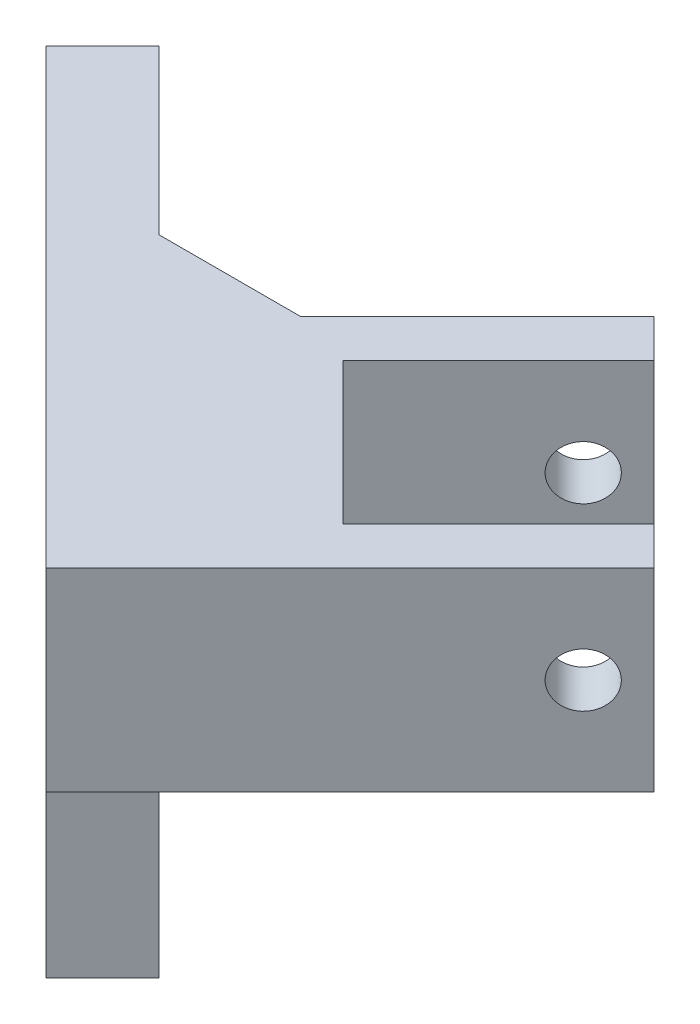
ISO-10303-21;
HEADER;
FILE_DESCRIPTION(('STEP AP214'),'2;1');
FILE_NAME('part.step','',(''),(''),'','','');
FILE_SCHEMA(('AUTOMOTIVE_DESIGN { 1 0 10303 214 1 1 1 1 }'));
ENDSEC;
DATA;
#1=APPLICATION_CONTEXT('core data for automotive mechanical design processes');
#2=APPLICATION_PROTOCOL_DEFINITION('international standard','automotive_design',2000,#1);
#3=PRODUCT_CONTEXT('',#1,'mechanical');
#4=PRODUCT('Part','Part','',(#3));
#5=PRODUCT_RELATED_PRODUCT_CATEGORY('part','',(#4));
#6=PRODUCT_DEFINITION_FORMATION('','',#4);
#7=PRODUCT_DEFINITION_CONTEXT('part definition',#1,'design');
#8=PRODUCT_DEFINITION('design','',#6,#7);
#9=PRODUCT_DEFINITION_SHAPE('','',#8);
#10=(LENGTH_UNIT() NAMED_UNIT(*) SI_UNIT(.MILLI.,.METRE.));
#11=(NAMED_UNIT(*) PLANE_ANGLE_UNIT() SI_UNIT($,.RADIAN.));
#12=(NAMED_UNIT(*) SI_UNIT($,.STERADIAN.) SOLID_ANGLE_UNIT());
#13=UNCERTAINTY_MEASURE_WITH_UNIT(LENGTH_MEASURE(1.E-05),#10,'distance_accuracy_value','');
#14=(GEOMETRIC_REPRESENTATION_CONTEXT(3) GLOBAL_UNCERTAINTY_ASSIGNED_CONTEXT((#13)) GLOBAL_UNIT_ASSIGNED_CONTEXT((#10,
#11,#12)) REPRESENTATION_CONTEXT('',''));
#15=CARTESIAN_POINT('',(0.,0.,0.));
#16=DIRECTION('',(0.,0.,1.));
#17=DIRECTION('',(1.,0.,0.));
#18=AXIS2_PLACEMENT_3D('',#15,#16,#17);
#19=CARTESIAN_POINT('',(31.0628181871188,32.8244024825225,-31.0628181871188));
#20=DIRECTION('',(0.,1.,0.));
#21=DIRECTION('',(0.,0.,1.));
#22=AXIS2_PLACEMENT_3D('',#19,#20,#21);
#23=PLANE('',#22);
#24=DIRECTION('',(0.707106781186547,0.,-0.707106781186548));
#25=VECTOR('',#24,1.);
#26=CARTESIAN_POINT('',(39.7549264490736,32.8244024825225,-22.370709925164));
#27=LINE('',#26,#25);
#28=CARTESIAN_POINT('',(54.6041688539911,32.8244024825225,-37.2199523300816));
#29=VERTEX_POINT('',#28);
#30=CARTESIAN_POINT('',(70.1605180400951,32.8244024825225,-52.7763015161856));
#31=VERTEX_POINT('',#30);
#32=EDGE_CURVE('E281',#29,#31,#27,.T.);
#33=ORIENTED_EDGE('',*,*,#32,.F.);
#34=DIRECTION('',(-0.707106781186546,0.,-0.707106781186549));
#35=VECTOR('',#34,1.);
#36=CARTESIAN_POINT('',(45.9120605920364,32.8244024825225,-45.9120605920363));
#37=LINE('',#36,#35);
#38=CARTESIAN_POINT('',(68.746304477722,32.8244024825225,-23.0778167063506));
#39=VERTEX_POINT('',#38);
#40=EDGE_CURVE('E283',#39,#29,#37,.T.);
#41=ORIENTED_EDGE('',*,*,#40,.F.);
#42=DIRECTION('',(-0.707106781186548,0.,0.707106781186547));
#43=VECTOR('',#42,1.);
#44=CARTESIAN_POINT('',(53.8970620728045,32.8244024825225,-8.22857430143308));
#45=LINE('',#44,#43);
#46=CARTESIAN_POINT('',(84.3026536638261,32.8244024825225,-38.6341658924546));
#47=VERTEX_POINT('',#46);
#48=EDGE_CURVE('E278',#47,#39,#45,.T.);
#49=ORIENTED_EDGE('',*,*,#48,.F.);
#50=DIRECTION('',(-0.707106781186547,0.,-0.707106781186547));
#51=VECTOR('',#50,1.);
#52=CARTESIAN_POINT('',(88.1320631514751,32.8244024825225,-34.8047564048057));
#53=LINE('',#52,#51);
#54=CARTESIAN_POINT('',(88.1320631514751,32.8244024825225,-34.8047564048057));
#55=VERTEX_POINT('',#54);
#56=EDGE_CURVE('E297',#55,#47,#53,.T.);
#57=ORIENTED_EDGE('',*,*,#56,.F.);
#58=DIRECTION('',(0.707106781186548,0.,-0.707106781186547));
#59=VECTOR('',#58,1.);
#60=CARTESIAN_POINT('',(57.7264715604535,32.8244024825225,-4.39916481378409));
#61=LINE('',#60,#59);
#62=CARTESIAN_POINT('',(57.7264715604535,32.8244024825225,-4.39916481378409));
#63=VERTEX_POINT('',#62);
#64=EDGE_CURVE('E354',#63,#55,#61,.T.);
#65=ORIENTED_EDGE('',*,*,#64,.F.);
#66=DIRECTION('',(0.707106781186547,0.,0.707106781186548));
#67=VECTOR('',#66,1.);
#68=CARTESIAN_POINT('',(31.0628181871188,32.8244024825225,-31.0628181871188));
#69=LINE('',#68,#67);
#70=CARTESIAN_POINT('',(31.0628181871188,32.8244024825225,-31.0628181871188));
#71=VERTEX_POINT('',#70);
#72=EDGE_CURVE('E315',#71,#63,#69,.T.);
#73=ORIENTED_EDGE('',*,*,#72,.F.);
#74=DIRECTION('',(0.707106781186548,0.,-0.707106781186547));
#75=VECTOR('',#74,1.);
#76=CARTESIAN_POINT('',(31.0628181871188,32.8244024825225,-31.0628181871188));
#77=LINE('',#76,#75);
#78=CARTESIAN_POINT('',(38.9280414741709,32.8244024825225,-38.9280414741709));
#79=VERTEX_POINT('',#78);
#80=EDGE_CURVE('E49',#71,#79,#77,.T.);
#81=ORIENTED_EDGE('',*,*,#80,.T.);
#82=DIRECTION('',(1.,0.,0.));
#83=VECTOR('',#82,1.);
#84=CARTESIAN_POINT('',(31.0628181871188,32.8244024825225,-38.9280414741709));
#85=LINE('',#84,#83);
#86=CARTESIAN_POINT('',(48.6534390227825,32.8244024825225,-38.9280414741709));
#87=VERTEX_POINT('',#86);
#88=EDGE_CURVE('E11',#79,#87,#85,.T.);
#89=ORIENTED_EDGE('',*,*,#88,.T.);
#90=DIRECTION('',(-0.707106781186548,0.,0.707106781186548));
#91=VECTOR('',#90,1.);
#92=CARTESIAN_POINT('',(66.3311085524461,32.8244024825225,-56.6057110038346));
#93=LINE('',#92,#91);
#94=CARTESIAN_POINT('',(66.3311085524461,32.8244024825225,-56.6057110038346));
#95=VERTEX_POINT('',#94);
#96=EDGE_CURVE('E305',#95,#87,#93,.T.);
#97=ORIENTED_EDGE('',*,*,#96,.F.);
#98=EDGE_CURVE('E296',#31,#95,#53,.T.);
#99=ORIENTED_EDGE('',*,*,#98,.F.);
#100=EDGE_LOOP('',(#33,#41,#49,#57,#65,#73,#81,#89,#97,#99));
#101=FACE_BOUND('',#100,.T.);
#102=ADVANCED_FACE('F34',(#101),#23,.F.);
#103=CARTESIAN_POINT('',(12.4905188287331,52.2462761201849,-49.6351175455045));
#104=DIRECTION('',(0.,-1.,0.));
#105=DIRECTION('',(0.,0.,-1.));
#106=AXIS2_PLACEMENT_3D('',#103,#104,#105);
#107=PLANE('',#106);
#108=DIRECTION('',(0.707106781186547,0.,-0.707106781186548));
#109=VECTOR('',#108,1.);
#110=CARTESIAN_POINT('',(54.6041688539911,52.2462761201849,-37.2199523300816));
#111=LINE('',#110,#109);
#112=CARTESIAN_POINT('',(54.6041688539911,52.2462761201849,-37.2199523300816));
#113=VERTEX_POINT('',#112);
#114=CARTESIAN_POINT('',(70.1605180400951,52.2462761201849,-52.7763015161856));
#115=VERTEX_POINT('',#114);
#116=EDGE_CURVE('E262',#113,#115,#111,.T.);
#117=ORIENTED_EDGE('',*,*,#116,.T.);
#118=DIRECTION('',(0.707106781186548,0.,0.707106781186547));
#119=VECTOR('',#118,1.);
#120=CARTESIAN_POINT('',(66.3311085524461,52.246276120185,-56.6057110038346));
#121=LINE('',#120,#119);
#122=CARTESIAN_POINT('',(66.3311085524461,52.246276120185,-56.6057110038346));
#123=VERTEX_POINT('',#122);
#124=EDGE_CURVE('E289',#123,#115,#121,.T.);
#125=ORIENTED_EDGE('',*,*,#124,.F.);
#126=DIRECTION('',(-0.707106781186548,0.,0.707106781186548));
#127=VECTOR('',#126,1.);
#128=CARTESIAN_POINT('',(66.3311085524461,52.246276120185,-56.6057110038346));
#129=LINE('',#128,#127);
#130=CARTESIAN_POINT('',(48.6534390227825,52.246276120185,-38.9280414741709));
#131=VERTEX_POINT('',#130);
#132=EDGE_CURVE('E302',#123,#131,#129,.T.);
#133=ORIENTED_EDGE('',*,*,#132,.T.);
#134=DIRECTION('',(-1.,0.,0.));
#135=VECTOR('',#134,1.);
#136=CARTESIAN_POINT('',(12.4905188287331,52.2462761201849,-38.9280414741708));
#137=LINE('',#136,#135);
#138=CARTESIAN_POINT('',(34.5113033990515,52.2462761201849,-38.9280414741709));
#139=VERTEX_POINT('',#138);
#140=EDGE_CURVE('E370',#131,#139,#137,.T.);
#141=ORIENTED_EDGE('',*,*,#140,.T.);
#142=DIRECTION('',(-0.707106781186547,0.,-0.707106781186548));
#143=VECTOR('',#142,1.);
#144=CARTESIAN_POINT('',(18.1473730782255,52.2462761201849,-55.2919717949969));
#145=LINE('',#144,#143);
#146=CARTESIAN_POINT('',(18.1473730782255,52.2462761201849,-55.2919717949969));
#147=VERTEX_POINT('',#146);
#148=EDGE_CURVE('E332',#139,#147,#145,.T.);
#149=ORIENTED_EDGE('',*,*,#148,.T.);
#150=DIRECTION('',(0.707106781186548,0.,-0.707106781186547));
#151=VECTOR('',#150,1.);
#152=CARTESIAN_POINT('',(12.4905188287331,52.2462761201849,-49.6351175455045));
#153=LINE('',#152,#151);
#154=CARTESIAN_POINT('',(12.4905188287331,52.2462761201849,-49.6351175455045));
#155=VERTEX_POINT('',#154);
#156=EDGE_CURVE('E348',#155,#147,#153,.T.);
#157=ORIENTED_EDGE('',*,*,#156,.F.);
#158=DIRECTION('',(-0.707106781186547,0.,-0.707106781186548));
#159=VECTOR('',#158,1.);
#160=CARTESIAN_POINT('',(12.4905188287331,52.2462761201849,-49.6351175455045));
#161=LINE('',#160,#159);
#162=CARTESIAN_POINT('',(57.7264715604535,52.2462761201849,-4.39916481378409));
#163=VERTEX_POINT('',#162);
#164=EDGE_CURVE('E319',#163,#155,#161,.T.);
#165=ORIENTED_EDGE('',*,*,#164,.F.);
#166=DIRECTION('',(0.707106781186548,0.,-0.707106781186547));
#167=VECTOR('',#166,1.);
#168=CARTESIAN_POINT('',(57.7264715604535,52.2462761201849,-4.39916481378409));
#169=LINE('',#168,#167);
#170=CARTESIAN_POINT('',(88.1320631514751,52.2462761201849,-34.8047564048057));
#171=VERTEX_POINT('',#170);
#172=EDGE_CURVE('E351',#163,#171,#169,.T.);
#173=ORIENTED_EDGE('',*,*,#172,.T.);
#174=CARTESIAN_POINT('',(84.3026536638261,52.2462761201849,-38.6341658924546));
#175=VERTEX_POINT('',#174);
#176=EDGE_CURVE('E293',#175,#171,#121,.T.);
#177=ORIENTED_EDGE('',*,*,#176,.F.);
#178=DIRECTION('',(-0.707106781186548,0.,0.707106781186547));
#179=VECTOR('',#178,1.);
#180=CARTESIAN_POINT('',(84.3026536638261,52.246276120185,-38.6341658924546));
#181=LINE('',#180,#179);
#182=CARTESIAN_POINT('',(68.746304477722,52.246276120185,-23.0778167063506));
#183=VERTEX_POINT('',#182);
#184=EDGE_CURVE('E265',#175,#183,#181,.T.);
#185=ORIENTED_EDGE('',*,*,#184,.T.);
#186=DIRECTION('',(-0.707106781186546,0.,-0.707106781186549));
#187=VECTOR('',#186,1.);
#188=CARTESIAN_POINT('',(68.746304477722,52.246276120185,-23.0778167063506));
#189=LINE('',#188,#187);
#190=EDGE_CURVE('E259',#183,#113,#189,.T.);
#191=ORIENTED_EDGE('',*,*,#190,.T.);
#192=EDGE_LOOP('',(#117,#125,#133,#141,#149,#157,#165,#173,#177,#185,#191));
#193=FACE_BOUND('',#192,.T.);
#194=ADVANCED_FACE('F434',(#193),#107,.F.);
#195=CARTESIAN_POINT('',(61.4684097781404,0.,-61.4684097781404));
#196=DIRECTION('',(0.707106781186547,0.,-0.707106781186548));
#197=DIRECTION('',(-0.707106781186548,0.,-0.707106781186547));
#198=AXIS2_PLACEMENT_3D('',#195,#196,#197);
#199=PLANE('',#198);
#200=ORIENTED_EDGE('',*,*,#124,.T.);
#201=DIRECTION('',(0.,1.,0.));
#202=VECTOR('',#201,1.);
#203=CARTESIAN_POINT('',(70.1605180400951,27.2462761201849,-52.7763015161856));
#204=LINE('',#203,#202);
#205=EDGE_CURVE('E273',#31,#115,#204,.T.);
#206=ORIENTED_EDGE('',*,*,#205,.F.);
#207=ORIENTED_EDGE('',*,*,#98,.T.);
#208=DIRECTION('',(0.,1.,0.));
#209=VECTOR('',#208,1.);
#210=CARTESIAN_POINT('',(66.3311085524461,32.8244024825225,-56.6057110038346));
#211=LINE('',#210,#209);
#212=EDGE_CURVE('E300',#95,#123,#211,.T.);
#213=ORIENTED_EDGE('',*,*,#212,.T.);
#214=EDGE_LOOP('',(#200,#206,#207,#213));
#215=FACE_BOUND('',#214,.T.);
#216=ADVANCED_FACE('F386',(#215),#199,.T.);
#217=ORIENTED_EDGE('',*,*,#56,.T.);
#218=DIRECTION('',(0.,1.,0.));
#219=VECTOR('',#218,1.);
#220=CARTESIAN_POINT('',(84.3026536638261,27.246276120185,-38.6341658924546));
#221=LINE('',#220,#219);
#222=EDGE_CURVE('E270',#47,#175,#221,.T.);
#223=ORIENTED_EDGE('',*,*,#222,.T.);
#224=ORIENTED_EDGE('',*,*,#176,.T.);
#225=DIRECTION('',(0.,-1.,0.));
#226=VECTOR('',#225,1.);
#227=CARTESIAN_POINT('',(88.1320631514751,52.2462761201849,-34.8047564048057));
#228=LINE('',#227,#226);
#229=EDGE_CURVE('E292',#171,#55,#228,.T.);
#230=ORIENTED_EDGE('',*,*,#229,.T.);
#231=EDGE_LOOP('',(#217,#223,#224,#230));
#232=FACE_BOUND('',#231,.T.);
#233=ADVANCED_FACE('F403',(#232),#199,.T.);
#234=CARTESIAN_POINT('',(52.7767240921477,42.5353393013537,-63.0890276522675));
#235=DIRECTION('',(0.707106781186547,0.,0.707106781186547));
#236=DIRECTION('',(0.707106781186548,0.,-0.707106781186548));
#237=AXIS2_PLACEMENT_3D('',#234,#235,#236);
#238=CYLINDRICAL_SURFACE('',#237,2.7);
#239=CARTESIAN_POINT('',(62.7955746465134,42.5353393013537,-53.0701770979018));
#240=DIRECTION('',(0.707106781186548,0.,0.707106781186548));
#241=DIRECTION('',(0.707106781186548,0.,-0.707106781186548));
#242=AXIS2_PLACEMENT_3D('',#239,#240,#241);
#243=CIRCLE('',#242,2.7);
#244=CARTESIAN_POINT('',(64.704762955717,42.5353393013537,-54.9793654071055));
#245=VERTEX_POINT('',#244);
#246=EDGE_CURVE('E288',#245,#245,#243,.T.);
#247=ORIENTED_EDGE('',*,*,#246,.F.);
#248=EDGE_LOOP('',(#247));
#249=FACE_BOUND('',#248,.T.);
#250=CARTESIAN_POINT('',(66.6249841341624,42.5353393013537,-49.2407676102528));
#251=DIRECTION('',(0.707106781186548,0.,0.707106781186547));
#252=DIRECTION('',(0.707106781186547,0.,-0.707106781186548));
#253=AXIS2_PLACEMENT_3D('',#250,#251,#252);
#254=CIRCLE('',#253,2.7);
#255=CARTESIAN_POINT('',(68.5341724433661,42.5353393013537,-51.1499559194565));
#256=VERTEX_POINT('',#255);
#257=EDGE_CURVE('E280',#256,#256,#254,.F.);
#258=ORIENTED_EDGE('',*,*,#257,.F.);
#259=EDGE_LOOP('',(#258));
#260=FACE_BOUND('',#259,.T.);
#261=ADVANCED_FACE('F460',(#249,#260),#238,.F.);
#262=CARTESIAN_POINT('',(84.5965292455423,42.5353393013537,-31.2692224988729));
#263=DIRECTION('',(0.707106781186548,0.,0.707106781186548));
#264=DIRECTION('',(0.707106781186548,0.,-0.707106781186548));
#265=AXIS2_PLACEMENT_3D('',#262,#263,#264);
#266=CIRCLE('',#265,2.7);
#267=CARTESIAN_POINT('',(86.505717554746,42.5353393013537,-33.1784108080766));
#268=VERTEX_POINT('',#267);
#269=EDGE_CURVE('E285',#268,#268,#266,.T.);
#270=ORIENTED_EDGE('',*,*,#269,.T.);
#271=EDGE_LOOP('',(#270));
#272=FACE_BOUND('',#271,.T.);
#273=CARTESIAN_POINT('',(80.7671197578933,42.5353393013537,-35.0986319865219));
#274=DIRECTION('',(-0.707106781186547,0.,-0.707106781186548));
#275=DIRECTION('',(-0.707106781186548,0.,0.707106781186547));
#276=AXIS2_PLACEMENT_3D('',#273,#274,#275);
#277=CIRCLE('',#276,2.7);
#278=CARTESIAN_POINT('',(78.8579314486897,42.5353393013537,-33.1894436773182));
#279=VERTEX_POINT('',#278);
#280=EDGE_CURVE('E277',#279,#279,#277,.F.);
#281=ORIENTED_EDGE('',*,*,#280,.F.);
#282=EDGE_LOOP('',(#281));
#283=FACE_BOUND('',#282,.T.);
#284=ADVANCED_FACE('F454',(#272,#283),#238,.F.);
#285=CARTESIAN_POINT('',(36.7196724366112,0.,-36.7196724366112));
#286=DIRECTION('',(0.707106781186548,0.,-0.707106781186547));
#287=DIRECTION('',(-0.707106781186547,0.,-0.707106781186548));
#288=AXIS2_PLACEMENT_3D('',#285,#286,#287);
#289=PLANE('',#288);
#290=CARTESIAN_POINT('',(23.9186035962073,-11.8888107983741,-49.5207412770151));
#291=DIRECTION('',(0.707106781186548,0.,-0.707106781186547));
#292=DIRECTION('',(-0.707106781186547,0.,-0.707106781186548));
#293=AXIS2_PLACEMENT_3D('',#290,#291,#292);
#294=CIRCLE('',#293,1.85);
#295=CARTESIAN_POINT('',(25.2267511414024,-11.8888107983741,-48.21259373182));
#296=VERTEX_POINT('',#295);
#297=CARTESIAN_POINT('',(22.6104560510122,-11.8888107983741,-50.8288888222102));
#298=VERTEX_POINT('',#297);
#299=EDGE_CURVE('E198',#296,#298,#294,.T.);
#300=ORIENTED_EDGE('',*,*,#299,.F.);
#301=DIRECTION('',(0.,-1.,0.));
#302=VECTOR('',#301,1.);
#303=CARTESIAN_POINT('',(25.2267511414024,0.,-48.21259373182));
#304=LINE('',#303,#302);
#305=CARTESIAN_POINT('',(25.2267511414024,19.9311892016259,-48.21259373182));
#306=VERTEX_POINT('',#305);
#307=EDGE_CURVE('E251',#306,#296,#304,.T.);
#308=ORIENTED_EDGE('',*,*,#307,.F.);
#309=CARTESIAN_POINT('',(23.9186035962073,19.9311892016259,-49.5207412770151));
#310=DIRECTION('',(0.707106781186548,0.,-0.707106781186547));
#311=DIRECTION('',(-0.707106781186547,0.,-0.707106781186548));
#312=AXIS2_PLACEMENT_3D('',#309,#310,#311);
#313=CIRCLE('',#312,1.85);
#314=CARTESIAN_POINT('',(22.6104560510122,19.9311892016259,-50.8288888222102));
#315=VERTEX_POINT('',#314);
#316=EDGE_CURVE('E253',#315,#306,#313,.T.);
#317=ORIENTED_EDGE('',*,*,#316,.F.);
#318=DIRECTION('',(0.,-1.,0.));
#319=VECTOR('',#318,1.);
#320=CARTESIAN_POINT('',(22.6104560510122,0.,-50.8288888222102));
#321=LINE('',#320,#319);
#322=EDGE_CURVE('E256',#315,#298,#321,.T.);
#323=ORIENTED_EDGE('',*,*,#322,.T.);
#324=EDGE_LOOP('',(#300,#308,#317,#323));
#325=FACE_BOUND('',#324,.T.);
#326=DIRECTION('',(0.,-1.,0.));
#327=VECTOR('',#326,1.);
#328=CARTESIAN_POINT('',(15.5393882391467,0.,-57.8999566340757));
#329=LINE('',#328,#327);
#330=CARTESIAN_POINT('',(15.5393882391467,19.9311892016259,-57.8999566340757));
#331=VERTEX_POINT('',#330);
#332=CARTESIAN_POINT('',(15.5393882391467,-11.8888107983741,-57.8999566340757));
#333=VERTEX_POINT('',#332);
#334=EDGE_CURVE('E249',#331,#333,#329,.T.);
#335=ORIENTED_EDGE('',*,*,#334,.F.);
#336=CARTESIAN_POINT('',(14.2312406939516,19.9311892016259,-59.2081041792708));
#337=DIRECTION('',(0.707106781186548,0.,-0.707106781186547));
#338=DIRECTION('',(-0.707106781186547,0.,-0.707106781186548));
#339=AXIS2_PLACEMENT_3D('',#336,#337,#338);
#340=CIRCLE('',#339,1.85);
#341=CARTESIAN_POINT('',(12.9230931487565,19.9311892016259,-60.5162517244659));
#342=VERTEX_POINT('',#341);
#343=EDGE_CURVE('E236',#342,#331,#340,.T.);
#344=ORIENTED_EDGE('',*,*,#343,.F.);
#345=DIRECTION('',(0.,-1.,0.));
#346=VECTOR('',#345,1.);
#347=CARTESIAN_POINT('',(12.9230931487565,0.,-60.5162517244659));
#348=LINE('',#347,#346);
#349=CARTESIAN_POINT('',(12.9230931487565,-11.8888107983741,-60.5162517244659));
#350=VERTEX_POINT('',#349);
#351=EDGE_CURVE('E244',#342,#350,#348,.T.);
#352=ORIENTED_EDGE('',*,*,#351,.T.);
#353=CARTESIAN_POINT('',(14.2312406939516,-11.8888107983741,-59.2081041792708));
#354=DIRECTION('',(0.707106781186548,0.,-0.707106781186547));
#355=DIRECTION('',(-0.707106781186547,0.,-0.707106781186548));
#356=AXIS2_PLACEMENT_3D('',#353,#354,#355);
#357=CIRCLE('',#356,1.85);
#358=EDGE_CURVE('E247',#333,#350,#357,.T.);
#359=ORIENTED_EDGE('',*,*,#358,.F.);
#360=EDGE_LOOP('',(#335,#344,#352,#359));
#361=FACE_BOUND('',#360,.T.);
#362=ORIENTED_EDGE('',*,*,#148,.F.);
#363=DIRECTION('',(0.,-1.,0.));
#364=VECTOR('',#363,1.);
#365=CARTESIAN_POINT('',(34.5113033990515,0.,-38.9280414741709));
#366=LINE('',#365,#364);
#367=CARTESIAN_POINT('',(34.5113033990515,29.7012970388808,-38.9280414741709));
#368=VERTEX_POINT('',#367);
#369=EDGE_CURVE('E57',#139,#368,#366,.T.);
#370=ORIENTED_EDGE('',*,*,#369,.T.);
#371=DIRECTION('',(0.500000000000001,0.707106781186546,0.500000000000001));
#372=VECTOR('',#371,1.);
#373=CARTESIAN_POINT('',(30.1332776936908,23.5098337099417,-43.3060671795316));
#374=LINE('',#373,#372);
#375=CARTESIAN_POINT('',(30.1332776936908,23.5098337099417,-43.3060671795316));
#376=VERTEX_POINT('',#375);
#377=EDGE_CURVE('E330',#376,#368,#374,.T.);
#378=ORIENTED_EDGE('',*,*,#377,.F.);
#379=DIRECTION('',(0.,1.,0.));
#380=VECTOR('',#379,1.);
#381=CARTESIAN_POINT('',(30.1332776936908,-16.523019044903,-43.3060671795316));
#382=LINE('',#381,#380);
#383=CARTESIAN_POINT('',(30.1332776936908,-16.523019044903,-43.3060671795316));
#384=VERTEX_POINT('',#383);
#385=EDGE_CURVE('E308',#384,#376,#382,.T.);
#386=ORIENTED_EDGE('',*,*,#385,.F.);
#387=DIRECTION('',(0.707106781186548,0.,0.707106781186548));
#388=VECTOR('',#387,1.);
#389=CARTESIAN_POINT('',(8.01656659646805,-16.523019044903,-65.4227782767543));
#390=LINE('',#389,#388);
#391=CARTESIAN_POINT('',(8.01656659646805,-16.523019044903,-65.4227782767543));
#392=VERTEX_POINT('',#391);
#393=EDGE_CURVE('E313',#392,#384,#390,.T.);
#394=ORIENTED_EDGE('',*,*,#393,.F.);
#395=DIRECTION('',(0.,-1.,0.));
#396=VECTOR('',#395,1.);
#397=CARTESIAN_POINT('',(8.01656659646804,32.8244024825225,-65.4227782767543));
#398=LINE('',#397,#396);
#399=CARTESIAN_POINT('',(8.01656659646804,37.9191521959063,-65.4227782767543));
#400=VERTEX_POINT('',#399);
#401=EDGE_CURVE('E337',#400,#392,#398,.T.);
#402=ORIENTED_EDGE('',*,*,#401,.F.);
#403=DIRECTION('',(-0.500000000000001,-0.707106781186546,-0.500000000000001));
#404=VECTOR('',#403,1.);
#405=CARTESIAN_POINT('',(8.01656659646804,37.9191521959063,-65.4227782767543));
#406=LINE('',#405,#404);
#407=EDGE_CURVE('E334',#147,#400,#406,.T.);
#408=ORIENTED_EDGE('',*,*,#407,.F.);
#409=EDGE_LOOP('',(#362,#370,#378,#386,#394,#402,#408));
#410=FACE_BOUND('',#409,.T.);
#411=ADVANCED_FACE('F419',(#325,#361,#410),#289,.T.);
#412=CARTESIAN_POINT('',(24.4764234441984,-16.523019044903,-37.6492129300392));
#413=DIRECTION('',(-0.707106781186547,0.,-0.707106781186548));
#414=DIRECTION('',(-0.707106781186548,0.,0.707106781186547));
#415=AXIS2_PLACEMENT_3D('',#412,#413,#414);
#416=PLANE('',#415);
#417=ORIENTED_EDGE('',*,*,#385,.T.);
#418=DIRECTION('',(0.707106781186548,0.,-0.707106781186547));
#419=VECTOR('',#418,1.);
#420=CARTESIAN_POINT('',(24.4764234441984,23.5098337099417,-37.6492129300392));
#421=LINE('',#420,#419);
#422=CARTESIAN_POINT('',(24.4764234441984,23.5098337099417,-37.6492129300392));
#423=VERTEX_POINT('',#422);
#424=EDGE_CURVE('E357',#423,#376,#421,.T.);
#425=ORIENTED_EDGE('',*,*,#424,.F.);
#426=DIRECTION('',(0.,1.,0.));
#427=VECTOR('',#426,1.);
#428=CARTESIAN_POINT('',(24.4764234441984,-16.523019044903,-37.6492129300392));
#429=LINE('',#428,#427);
#430=CARTESIAN_POINT('',(24.4764234441984,-16.523019044903,-37.6492129300392));
#431=VERTEX_POINT('',#430);
#432=EDGE_CURVE('E309',#431,#423,#429,.T.);
#433=ORIENTED_EDGE('',*,*,#432,.F.);
#434=DIRECTION('',(0.707106781186548,0.,-0.707106781186547));
#435=VECTOR('',#434,1.);
#436=CARTESIAN_POINT('',(24.4764234441984,-16.523019044903,-37.6492129300392));
#437=LINE('',#436,#435);
#438=EDGE_CURVE('E327',#431,#384,#437,.T.);
#439=ORIENTED_EDGE('',*,*,#438,.T.);
#440=EDGE_LOOP('',(#417,#425,#433,#439));
#441=FACE_BOUND('',#440,.T.);
#442=ADVANCED_FACE('F416',(#441),#416,.F.);
#443=CARTESIAN_POINT('',(24.4764234441984,23.5098337099417,-37.6492129300392));
#444=DIRECTION('',(-0.499999999999999,0.707106781186549,-0.499999999999999));
#445=DIRECTION('',(0.,0.577350269189624,0.816496580927727));
#446=AXIS2_PLACEMENT_3D('',#443,#444,#445);
#447=PLANE('',#446);
#448=ORIENTED_EDGE('',*,*,#377,.T.);
#449=DIRECTION('',(0.816496580927729,0.577350269189622,0.));
#450=VECTOR('',#449,1.);
#451=CARTESIAN_POINT('',(24.9026996255756,22.9069881529214,-38.9280414741708));
#452=LINE('',#451,#450);
#453=EDGE_CURVE('E43',#368,#79,#452,.T.);
#454=ORIENTED_EDGE('',*,*,#453,.T.);
#455=ORIENTED_EDGE('',*,*,#80,.F.);
#456=DIRECTION('',(0.500000000000001,0.707106781186546,0.500000000000001));
#457=VECTOR('',#456,1.);
#458=CARTESIAN_POINT('',(24.4764234441984,23.5098337099417,-37.6492129300392));
#459=LINE('',#458,#457);
#460=EDGE_CURVE('E312',#423,#71,#459,.T.);
#461=ORIENTED_EDGE('',*,*,#460,.F.);
#462=ORIENTED_EDGE('',*,*,#424,.T.);
#463=EDGE_LOOP('',(#448,#454,#455,#461,#462));
#464=FACE_BOUND('',#463,.T.);
#465=ADVANCED_FACE('F374',(#464),#447,.F.);
#466=CARTESIAN_POINT('',(57.7264715604535,52.2462761201849,-4.39916481378409));
#467=DIRECTION('',(-0.707106781186547,0.,-0.707106781186548));
#468=DIRECTION('',(-0.707106781186548,0.,0.707106781186547));
#469=AXIS2_PLACEMENT_3D('',#466,#467,#468);
#470=PLANE('',#469);
#471=ORIENTED_EDGE('',*,*,#269,.F.);
#472=EDGE_LOOP('',(#471));
#473=FACE_BOUND('',#472,.T.);
#474=ORIENTED_EDGE('',*,*,#64,.T.);
#475=ORIENTED_EDGE('',*,*,#229,.F.);
#476=ORIENTED_EDGE('',*,*,#172,.F.);
#477=DIRECTION('',(0.,1.,0.));
#478=VECTOR('',#477,1.);
#479=CARTESIAN_POINT('',(57.7264715604535,52.2462761201849,-4.39916481378409));
#480=LINE('',#479,#478);
#481=EDGE_CURVE('E317',#63,#163,#480,.T.);
#482=ORIENTED_EDGE('',*,*,#481,.F.);
#483=EDGE_LOOP('',(#474,#475,#476,#482));
#484=FACE_BOUND('',#483,.T.);
#485=ADVANCED_FACE('F408',(#473,#484),#470,.F.);
#486=CARTESIAN_POINT('',(2.35971234697566,37.9191521959063,-59.765924027262));
#487=DIRECTION('',(0.499999999999999,-0.707106781186549,0.499999999999999));
#488=DIRECTION('',(0.,-0.577350269189625,-0.816496580927727));
#489=AXIS2_PLACEMENT_3D('',#486,#487,#488);
#490=PLANE('',#489);
#491=ORIENTED_EDGE('',*,*,#407,.T.);
#492=DIRECTION('',(0.707106781186548,0.,-0.707106781186547));
#493=VECTOR('',#492,1.);
#494=CARTESIAN_POINT('',(2.35971234697566,37.9191521959063,-59.765924027262));
#495=LINE('',#494,#493);
#496=CARTESIAN_POINT('',(2.35971234697566,37.9191521959063,-59.765924027262));
#497=VERTEX_POINT('',#496);
#498=EDGE_CURVE('E345',#497,#400,#495,.T.);
#499=ORIENTED_EDGE('',*,*,#498,.F.);
#500=DIRECTION('',(-0.500000000000001,-0.707106781186546,-0.500000000000001));
#501=VECTOR('',#500,1.);
#502=CARTESIAN_POINT('',(2.35971234697566,37.9191521959063,-59.765924027262));
#503=LINE('',#502,#501);
#504=EDGE_CURVE('E321',#155,#497,#503,.T.);
#505=ORIENTED_EDGE('',*,*,#504,.F.);
#506=ORIENTED_EDGE('',*,*,#156,.T.);
#507=EDGE_LOOP('',(#491,#499,#505,#506));
#508=FACE_BOUND('',#507,.T.);
#509=ADVANCED_FACE('F431',(#508),#490,.F.);
#510=CARTESIAN_POINT('',(2.35971234697566,32.8244024825225,-59.765924027262));
#511=DIRECTION('',(0.707106781186547,0.,0.707106781186548));
#512=DIRECTION('',(0.707106781186548,0.,-0.707106781186547));
#513=AXIS2_PLACEMENT_3D('',#510,#511,#512);
#514=PLANE('',#513);
#515=ORIENTED_EDGE('',*,*,#401,.T.);
#516=DIRECTION('',(0.707106781186548,0.,-0.707106781186547));
#517=VECTOR('',#516,1.);
#518=CARTESIAN_POINT('',(2.35971234697567,-16.523019044903,-59.7659240272619));
#519=LINE('',#518,#517);
#520=CARTESIAN_POINT('',(2.35971234697567,-16.523019044903,-59.7659240272619));
#521=VERTEX_POINT('',#520);
#522=EDGE_CURVE('E342',#521,#392,#519,.T.);
#523=ORIENTED_EDGE('',*,*,#522,.F.);
#524=DIRECTION('',(0.,-1.,0.));
#525=VECTOR('',#524,1.);
#526=CARTESIAN_POINT('',(2.35971234697566,32.8244024825225,-59.765924027262));
#527=LINE('',#526,#525);
#528=EDGE_CURVE('E323',#497,#521,#527,.T.);
#529=ORIENTED_EDGE('',*,*,#528,.F.);
#530=ORIENTED_EDGE('',*,*,#498,.T.);
#531=EDGE_LOOP('',(#515,#523,#529,#530));
#532=FACE_BOUND('',#531,.T.);
#533=ADVANCED_FACE('F427',(#532),#514,.F.);
#534=CARTESIAN_POINT('',(2.35971234697567,-16.523019044903,-59.7659240272619));
#535=DIRECTION('',(0.,1.,0.));
#536=DIRECTION('',(0.,0.,1.));
#537=AXIS2_PLACEMENT_3D('',#534,#535,#536);
#538=PLANE('',#537);
#539=ORIENTED_EDGE('',*,*,#393,.T.);
#540=ORIENTED_EDGE('',*,*,#438,.F.);
#541=DIRECTION('',(0.707106781186548,0.,0.707106781186548));
#542=VECTOR('',#541,1.);
#543=CARTESIAN_POINT('',(2.35971234697567,-16.523019044903,-59.7659240272619));
#544=LINE('',#543,#542);
#545=EDGE_CURVE('E325',#521,#431,#544,.T.);
#546=ORIENTED_EDGE('',*,*,#545,.F.);
#547=ORIENTED_EDGE('',*,*,#522,.T.);
#548=EDGE_LOOP('',(#539,#540,#546,#547));
#549=FACE_BOUND('',#548,.T.);
#550=ADVANCED_FACE('F422',(#549),#538,.F.);
#551=CARTESIAN_POINT('',(31.0628181871188,0.,-31.0628181871188));
#552=DIRECTION('',(0.707106781186548,0.,-0.707106781186547));
#553=DIRECTION('',(-0.707106781186547,0.,-0.707106781186548));
#554=AXIS2_PLACEMENT_3D('',#551,#552,#553);
#555=PLANE('',#554);
#556=DIRECTION('',(0.,1.,0.));
#557=VECTOR('',#556,1.);
#558=CARTESIAN_POINT('',(19.56989689191,-11.8888107983741,-42.5557394823276));
#559=LINE('',#558,#557);
#560=CARTESIAN_POINT('',(19.56989689191,-11.8888107983741,-42.5557394823276));
#561=VERTEX_POINT('',#560);
#562=CARTESIAN_POINT('',(19.56989689191,19.9311892016259,-42.5557394823276));
#563=VERTEX_POINT('',#562);
#564=EDGE_CURVE('E217',#561,#563,#559,.T.);
#565=ORIENTED_EDGE('',*,*,#564,.F.);
#566=CARTESIAN_POINT('',(18.2617493467149,-11.8888107983741,-43.8638870275227));
#567=DIRECTION('',(-0.707106781186548,0.,0.707106781186547));
#568=DIRECTION('',(0.707106781186547,0.,0.707106781186548));
#569=AXIS2_PLACEMENT_3D('',#566,#567,#568);
#570=CIRCLE('',#569,1.85);
#571=CARTESIAN_POINT('',(16.9536018015198,-11.8888107983741,-45.1720345727178));
#572=VERTEX_POINT('',#571);
#573=EDGE_CURVE('E195',#572,#561,#570,.T.);
#574=ORIENTED_EDGE('',*,*,#573,.F.);
#575=DIRECTION('',(0.,1.,0.));
#576=VECTOR('',#575,1.);
#577=CARTESIAN_POINT('',(16.9536018015198,-11.8888107983741,-45.1720345727178));
#578=LINE('',#577,#576);
#579=CARTESIAN_POINT('',(16.9536018015198,19.9311892016259,-45.1720345727178));
#580=VERTEX_POINT('',#579);
#581=EDGE_CURVE('E204',#572,#580,#578,.T.);
#582=ORIENTED_EDGE('',*,*,#581,.T.);
#583=CARTESIAN_POINT('',(18.2617493467149,19.9311892016259,-43.8638870275227));
#584=DIRECTION('',(-0.707106781186548,0.,0.707106781186547));
#585=DIRECTION('',(0.707106781186547,0.,0.707106781186548));
#586=AXIS2_PLACEMENT_3D('',#583,#584,#585);
#587=CIRCLE('',#586,1.85);
#588=EDGE_CURVE('E210',#563,#580,#587,.T.);
#589=ORIENTED_EDGE('',*,*,#588,.F.);
#590=EDGE_LOOP('',(#565,#574,#582,#589));
#591=FACE_BOUND('',#590,.T.);
#592=CARTESIAN_POINT('',(8.57438644445921,19.9311892016259,-53.5512499297784));
#593=DIRECTION('',(-0.707106781186548,0.,0.707106781186547));
#594=DIRECTION('',(0.707106781186547,0.,0.707106781186548));
#595=AXIS2_PLACEMENT_3D('',#592,#593,#594);
#596=CIRCLE('',#595,1.85);
#597=CARTESIAN_POINT('',(9.88253398965432,19.9311892016259,-52.2431023845833));
#598=VERTEX_POINT('',#597);
#599=CARTESIAN_POINT('',(7.26623889926411,19.9311892016259,-54.8593974749735));
#600=VERTEX_POINT('',#599);
#601=EDGE_CURVE('E220',#598,#600,#596,.T.);
#602=ORIENTED_EDGE('',*,*,#601,.F.);
#603=DIRECTION('',(0.,1.,0.));
#604=VECTOR('',#603,1.);
#605=CARTESIAN_POINT('',(9.88253398965432,0.,-52.2431023845833));
#606=LINE('',#605,#604);
#607=CARTESIAN_POINT('',(9.88253398965431,-11.8888107983741,-52.2431023845833));
#608=VERTEX_POINT('',#607);
#609=EDGE_CURVE('E218',#608,#598,#606,.T.);
#610=ORIENTED_EDGE('',*,*,#609,.F.);
#611=CARTESIAN_POINT('',(8.57438644445921,-11.8888107983741,-53.5512499297784));
#612=DIRECTION('',(-0.707106781186548,0.,0.707106781186547));
#613=DIRECTION('',(0.707106781186547,0.,0.707106781186548));
#614=AXIS2_PLACEMENT_3D('',#611,#612,#613);
#615=CIRCLE('',#614,1.85);
#616=CARTESIAN_POINT('',(7.2662388992641,-11.8888107983741,-54.8593974749735));
#617=VERTEX_POINT('',#616);
#618=EDGE_CURVE('E230',#617,#608,#615,.T.);
#619=ORIENTED_EDGE('',*,*,#618,.F.);
#620=DIRECTION('',(0.,1.,0.));
#621=VECTOR('',#620,1.);
#622=CARTESIAN_POINT('',(7.26623889926411,0.,-54.8593974749735));
#623=LINE('',#622,#621);
#624=EDGE_CURVE('E227',#617,#600,#623,.T.);
#625=ORIENTED_EDGE('',*,*,#624,.T.);
#626=EDGE_LOOP('',(#602,#610,#619,#625));
#627=FACE_BOUND('',#626,.T.);
#628=ORIENTED_EDGE('',*,*,#432,.T.);
#629=ORIENTED_EDGE('',*,*,#460,.T.);
#630=ORIENTED_EDGE('',*,*,#72,.T.);
#631=ORIENTED_EDGE('',*,*,#481,.T.);
#632=ORIENTED_EDGE('',*,*,#164,.T.);
#633=ORIENTED_EDGE('',*,*,#504,.T.);
#634=ORIENTED_EDGE('',*,*,#528,.T.);
#635=ORIENTED_EDGE('',*,*,#545,.T.);
#636=EDGE_LOOP('',(#628,#629,#630,#631,#632,#633,#634,#635));
#637=FACE_BOUND('',#636,.T.);
#638=ADVANCED_FACE('F214',(#591,#627,#637),#555,.F.);
#639=CARTESIAN_POINT('',(66.3311085524461,32.8244024825225,-56.6057110038346));
#640=DIRECTION('',(0.707106781186548,0.,0.707106781186548));
#641=DIRECTION('',(0.707106781186548,0.,-0.707106781186548));
#642=AXIS2_PLACEMENT_3D('',#639,#640,#641);
#643=PLANE('',#642);
#644=ORIENTED_EDGE('',*,*,#246,.T.);
#645=EDGE_LOOP('',(#644));
#646=FACE_BOUND('',#645,.T.);
#647=ORIENTED_EDGE('',*,*,#96,.T.);
#648=DIRECTION('',(0.,1.,0.));
#649=VECTOR('',#648,1.);
#650=CARTESIAN_POINT('',(48.6534390227825,32.8244024825225,-38.9280414741709));
#651=LINE('',#650,#649);
#652=EDGE_CURVE('E360',#87,#131,#651,.T.);
#653=ORIENTED_EDGE('',*,*,#652,.T.);
#654=ORIENTED_EDGE('',*,*,#132,.F.);
#655=ORIENTED_EDGE('',*,*,#212,.F.);
#656=EDGE_LOOP('',(#647,#653,#654,#655));
#657=FACE_BOUND('',#656,.T.);
#658=ADVANCED_FACE('F382',(#646,#657),#643,.F.);
#659=CARTESIAN_POINT('',(68.746304477722,27.246276120185,-23.0778167063506));
#660=DIRECTION('',(0.707106781186549,0.,-0.707106781186546));
#661=DIRECTION('',(-0.707106781186546,0.,-0.707106781186549));
#662=AXIS2_PLACEMENT_3D('',#659,#660,#661);
#663=PLANE('',#662);
#664=ORIENTED_EDGE('',*,*,#40,.T.);
#665=DIRECTION('',(0.,1.,0.));
#666=VECTOR('',#665,1.);
#667=CARTESIAN_POINT('',(54.6041688539911,27.2462761201849,-37.2199523300816));
#668=LINE('',#667,#666);
#669=EDGE_CURVE('E275',#29,#113,#668,.T.);
#670=ORIENTED_EDGE('',*,*,#669,.T.);
#671=ORIENTED_EDGE('',*,*,#190,.F.);
#672=DIRECTION('',(0.,1.,0.));
#673=VECTOR('',#672,1.);
#674=CARTESIAN_POINT('',(68.746304477722,27.246276120185,-23.0778167063506));
#675=LINE('',#674,#673);
#676=EDGE_CURVE('E268',#39,#183,#675,.T.);
#677=ORIENTED_EDGE('',*,*,#676,.F.);
#678=EDGE_LOOP('',(#664,#670,#671,#677));
#679=FACE_BOUND('',#678,.T.);
#680=ADVANCED_FACE('F396',(#679),#663,.T.);
#681=CARTESIAN_POINT('',(54.6041688539911,27.2462761201849,-37.2199523300816));
#682=DIRECTION('',(0.707106781186548,0.,0.707106781186547));
#683=DIRECTION('',(0.707106781186547,0.,-0.707106781186548));
#684=AXIS2_PLACEMENT_3D('',#681,#682,#683);
#685=PLANE('',#684);
#686=ORIENTED_EDGE('',*,*,#257,.T.);
#687=EDGE_LOOP('',(#686));
#688=FACE_BOUND('',#687,.T.);
#689=ORIENTED_EDGE('',*,*,#32,.T.);
#690=ORIENTED_EDGE('',*,*,#205,.T.);
#691=ORIENTED_EDGE('',*,*,#116,.F.);
#692=ORIENTED_EDGE('',*,*,#669,.F.);
#693=EDGE_LOOP('',(#689,#690,#691,#692));
#694=FACE_BOUND('',#693,.T.);
#695=ADVANCED_FACE('F392',(#688,#694),#685,.T.);
#696=CARTESIAN_POINT('',(84.3026536638261,27.246276120185,-38.6341658924546));
#697=DIRECTION('',(-0.707106781186547,0.,-0.707106781186548));
#698=DIRECTION('',(-0.707106781186548,0.,0.707106781186547));
#699=AXIS2_PLACEMENT_3D('',#696,#697,#698);
#700=PLANE('',#699);
#701=ORIENTED_EDGE('',*,*,#280,.T.);
#702=EDGE_LOOP('',(#701));
#703=FACE_BOUND('',#702,.T.);
#704=ORIENTED_EDGE('',*,*,#48,.T.);
#705=ORIENTED_EDGE('',*,*,#676,.T.);
#706=ORIENTED_EDGE('',*,*,#184,.F.);
#707=ORIENTED_EDGE('',*,*,#222,.F.);
#708=EDGE_LOOP('',(#704,#705,#706,#707));
#709=FACE_BOUND('',#708,.T.);
#710=ADVANCED_FACE('F399',(#703,#709),#700,.T.);
#711=CARTESIAN_POINT('',(41.702339143049,0.,-84.0629075379779));
#712=DIRECTION('',(0.707106781186547,0.,0.707106781186547));
#713=DIRECTION('',(0.707106781186548,0.,-0.707106781186547));
#714=AXIS2_PLACEMENT_3D('',#711,#712,#713);
#715=PLANE('',#714);
#716=ORIENTED_EDGE('',*,*,#334,.T.);
#717=DIRECTION('',(-0.707106781186547,0.,0.707106781186547));
#718=VECTOR('',#717,1.);
#719=CARTESIAN_POINT('',(41.702339143049,-11.8888107983741,-84.0629075379779));
#720=LINE('',#719,#718);
#721=EDGE_CURVE('E234',#333,#608,#720,.T.);
#722=ORIENTED_EDGE('',*,*,#721,.T.);
#723=ORIENTED_EDGE('',*,*,#609,.T.);
#724=DIRECTION('',(-0.707106781186547,0.,0.707106781186547));
#725=VECTOR('',#724,1.);
#726=CARTESIAN_POINT('',(41.702339143049,19.9311892016259,-84.0629075379779));
#727=LINE('',#726,#725);
#728=EDGE_CURVE('E233',#331,#598,#727,.T.);
#729=ORIENTED_EDGE('',*,*,#728,.F.);
#730=EDGE_LOOP('',(#716,#722,#723,#729));
#731=FACE_BOUND('',#730,.T.);
#732=ADVANCED_FACE('F592',(#731),#715,.F.);
#733=CARTESIAN_POINT('',(40.3941915978539,-11.8888107983741,-85.3710550831731));
#734=DIRECTION('',(-0.707106781186547,0.,0.707106781186547));
#735=DIRECTION('',(0.707106781186547,0.,0.707106781186548));
#736=AXIS2_PLACEMENT_3D('',#733,#734,#735);
#737=CYLINDRICAL_SURFACE('',#736,1.85);
#738=ORIENTED_EDGE('',*,*,#358,.T.);
#739=DIRECTION('',(-0.707106781186547,0.,0.707106781186547));
#740=VECTOR('',#739,1.);
#741=CARTESIAN_POINT('',(39.0860440526587,-11.8888107983741,-86.6792026283682));
#742=LINE('',#741,#740);
#743=EDGE_CURVE('E237',#350,#617,#742,.T.);
#744=ORIENTED_EDGE('',*,*,#743,.T.);
#745=ORIENTED_EDGE('',*,*,#618,.T.);
#746=ORIENTED_EDGE('',*,*,#721,.F.);
#747=EDGE_LOOP('',(#738,#744,#745,#746));
#748=FACE_BOUND('',#747,.T.);
#749=ADVANCED_FACE('F602',(#748),#737,.F.);
#750=CARTESIAN_POINT('',(39.0860440526587,0.,-86.6792026283682));
#751=DIRECTION('',(0.707106781186547,0.,0.707106781186547));
#752=DIRECTION('',(0.707106781186548,0.,-0.707106781186547));
#753=AXIS2_PLACEMENT_3D('',#750,#751,#752);
#754=PLANE('',#753);
#755=DIRECTION('',(-0.707106781186547,0.,0.707106781186547));
#756=VECTOR('',#755,1.);
#757=CARTESIAN_POINT('',(39.0860440526587,19.9311892016259,-86.6792026283682));
#758=LINE('',#757,#756);
#759=EDGE_CURVE('E239',#342,#600,#758,.T.);
#760=ORIENTED_EDGE('',*,*,#759,.T.);
#761=ORIENTED_EDGE('',*,*,#624,.F.);
#762=ORIENTED_EDGE('',*,*,#743,.F.);
#763=ORIENTED_EDGE('',*,*,#351,.F.);
#764=EDGE_LOOP('',(#760,#761,#762,#763));
#765=FACE_BOUND('',#764,.T.);
#766=ADVANCED_FACE('F612',(#765),#754,.T.);
#767=CARTESIAN_POINT('',(40.3941915978539,19.9311892016259,-85.3710550831731));
#768=DIRECTION('',(-0.707106781186547,0.,0.707106781186547));
#769=DIRECTION('',(0.707106781186547,0.,0.707106781186548));
#770=AXIS2_PLACEMENT_3D('',#767,#768,#769);
#771=CYLINDRICAL_SURFACE('',#770,1.85);
#772=ORIENTED_EDGE('',*,*,#343,.T.);
#773=ORIENTED_EDGE('',*,*,#728,.T.);
#774=ORIENTED_EDGE('',*,*,#601,.T.);
#775=ORIENTED_EDGE('',*,*,#759,.F.);
#776=EDGE_LOOP('',(#772,#773,#774,#775));
#777=FACE_BOUND('',#776,.T.);
#778=ADVANCED_FACE('F622',(#777),#771,.F.);
#779=CARTESIAN_POINT('',(50.0815545001095,-11.8888107983741,-75.6836921809174));
#780=DIRECTION('',(-0.707106781186547,0.,0.707106781186547));
#781=DIRECTION('',(0.707106781186547,0.,0.707106781186548));
#782=AXIS2_PLACEMENT_3D('',#779,#780,#781);
#783=CYLINDRICAL_SURFACE('',#782,1.85);
#784=ORIENTED_EDGE('',*,*,#299,.T.);
#785=DIRECTION('',(-0.707106781186547,0.,0.707106781186547));
#786=VECTOR('',#785,1.);
#787=CARTESIAN_POINT('',(48.7734069549144,-11.8888107983741,-76.9918397261125));
#788=LINE('',#787,#786);
#789=EDGE_CURVE('E190',#298,#572,#788,.T.);
#790=ORIENTED_EDGE('',*,*,#789,.T.);
#791=ORIENTED_EDGE('',*,*,#573,.T.);
#792=DIRECTION('',(-0.707106781186547,0.,0.707106781186547));
#793=VECTOR('',#792,1.);
#794=CARTESIAN_POINT('',(51.3897020453047,-11.8888107983741,-74.3755446357222));
#795=LINE('',#794,#793);
#796=EDGE_CURVE('E211',#296,#561,#795,.T.);
#797=ORIENTED_EDGE('',*,*,#796,.F.);
#798=EDGE_LOOP('',(#784,#790,#791,#797));
#799=FACE_BOUND('',#798,.T.);
#800=ADVANCED_FACE('F192',(#799),#783,.F.);
#801=CARTESIAN_POINT('',(48.7734069549144,-11.8888107983741,-76.9918397261125));
#802=DIRECTION('',(0.707106781186547,0.,0.707106781186547));
#803=DIRECTION('',(0.707106781186548,0.,-0.707106781186547));
#804=AXIS2_PLACEMENT_3D('',#801,#802,#803);
#805=PLANE('',#804);
#806=DIRECTION('',(-0.707106781186547,0.,0.707106781186547));
#807=VECTOR('',#806,1.);
#808=CARTESIAN_POINT('',(48.7734069549144,19.9311892016259,-76.9918397261125));
#809=LINE('',#808,#807);
#810=EDGE_CURVE('E201',#315,#580,#809,.T.);
#811=ORIENTED_EDGE('',*,*,#810,.T.);
#812=ORIENTED_EDGE('',*,*,#581,.F.);
#813=ORIENTED_EDGE('',*,*,#789,.F.);
#814=ORIENTED_EDGE('',*,*,#322,.F.);
#815=EDGE_LOOP('',(#811,#812,#813,#814));
#816=FACE_BOUND('',#815,.T.);
#817=ADVANCED_FACE('F205',(#816),#805,.T.);
#818=CARTESIAN_POINT('',(50.0815545001095,19.9311892016259,-75.6836921809174));
#819=DIRECTION('',(-0.707106781186547,0.,0.707106781186547));
#820=DIRECTION('',(0.707106781186547,0.,0.707106781186548));
#821=AXIS2_PLACEMENT_3D('',#818,#819,#820);
#822=CYLINDRICAL_SURFACE('',#821,1.85);
#823=ORIENTED_EDGE('',*,*,#316,.T.);
#824=DIRECTION('',(-0.707106781186547,0.,0.707106781186547));
#825=VECTOR('',#824,1.);
#826=CARTESIAN_POINT('',(51.3897020453047,19.9311892016259,-74.3755446357222));
#827=LINE('',#826,#825);
#828=EDGE_CURVE('E678',#306,#563,#827,.T.);
#829=ORIENTED_EDGE('',*,*,#828,.T.);
#830=ORIENTED_EDGE('',*,*,#588,.T.);
#831=ORIENTED_EDGE('',*,*,#810,.F.);
#832=EDGE_LOOP('',(#823,#829,#830,#831));
#833=FACE_BOUND('',#832,.T.);
#834=ADVANCED_FACE('F649',(#833),#822,.F.);
#835=CARTESIAN_POINT('',(51.3897020453047,-11.8888107983741,-74.3755446357222));
#836=DIRECTION('',(0.707106781186547,0.,0.707106781186547));
#837=DIRECTION('',(0.707106781186548,0.,-0.707106781186547));
#838=AXIS2_PLACEMENT_3D('',#835,#836,#837);
#839=PLANE('',#838);
#840=ORIENTED_EDGE('',*,*,#307,.T.);
#841=ORIENTED_EDGE('',*,*,#796,.T.);
#842=ORIENTED_EDGE('',*,*,#564,.T.);
#843=ORIENTED_EDGE('',*,*,#828,.F.);
#844=EDGE_LOOP('',(#840,#841,#842,#843));
#845=FACE_BOUND('',#844,.T.);
#846=ADVANCED_FACE('F658',(#845),#839,.F.);
#847=CARTESIAN_POINT('',(48.6534390227825,32.8244024825225,-38.9280414741709));
#848=DIRECTION('',(0.,0.,1.));
#849=DIRECTION('',(0.,1.,0.));
#850=AXIS2_PLACEMENT_3D('',#847,#848,#849);
#851=PLANE('',#850);
#852=ORIENTED_EDGE('',*,*,#453,.F.);
#853=ORIENTED_EDGE('',*,*,#369,.F.);
#854=ORIENTED_EDGE('',*,*,#140,.F.);
#855=ORIENTED_EDGE('',*,*,#652,.F.);
#856=ORIENTED_EDGE('',*,*,#88,.F.);
#857=EDGE_LOOP('',(#852,#853,#854,#855,#856));
#858=FACE_BOUND('',#857,.T.);
#859=ADVANCED_FACE('F37',(#858),#851,.F.);
#860=CLOSED_SHELL('',(#102,#194,#216,#233,#261,#284,#411,#442,#465,#485,#509,#533,#550,#638,
#658,#680,#695,#710,#732,#749,#766,#778,#800,#817,#834,#846,#859));
#861=MANIFOLD_SOLID_BREP('B2',#860);
#862=ADVANCED_BREP_SHAPE_REPRESENTATION('',(#18,#861),#14);
#863=SHAPE_DEFINITION_REPRESENTATION(#9,#862);
ENDSEC;
END-ISO-10303-21;
